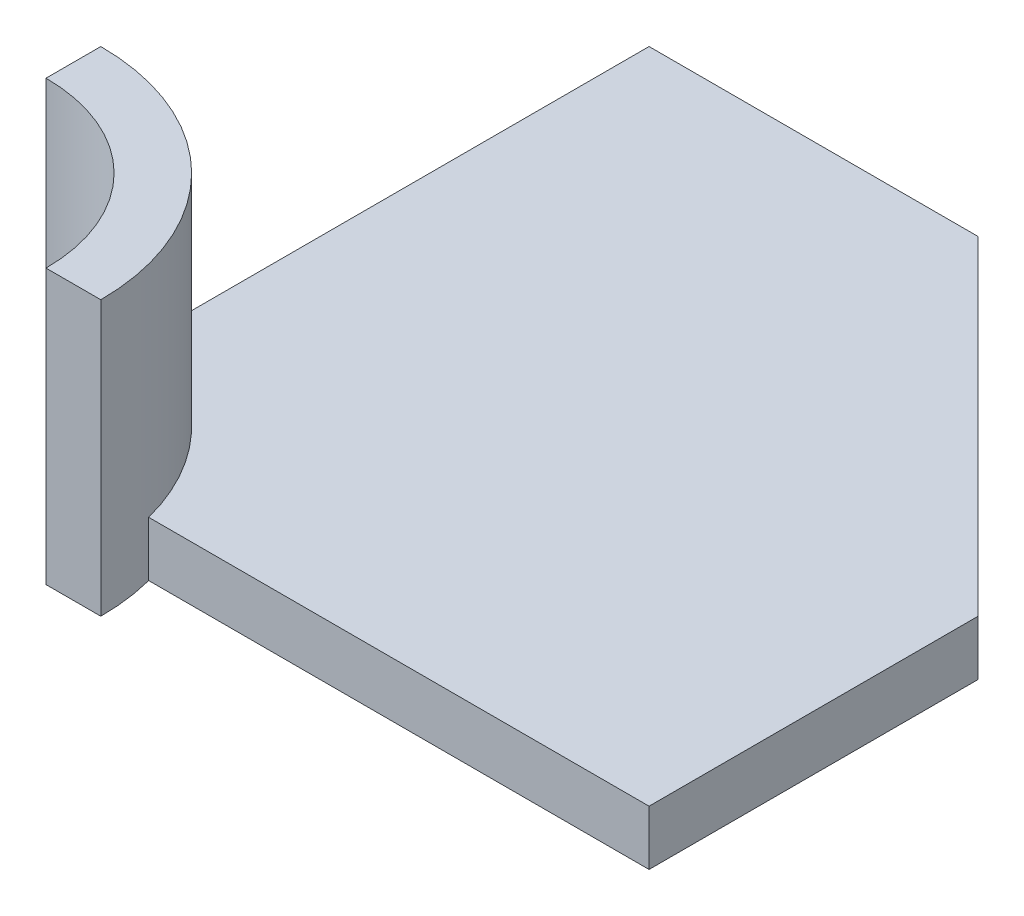
ISO-10303-21;
HEADER;
FILE_DESCRIPTION(('STEP AP214'),'2;1');
FILE_NAME('part.step','',(''),(''),'','','');
FILE_SCHEMA(('AUTOMOTIVE_DESIGN { 1 0 10303 214 1 1 1 1 }'));
ENDSEC;
DATA;
#1=APPLICATION_CONTEXT('core data for automotive mechanical design processes');
#2=APPLICATION_PROTOCOL_DEFINITION('international standard','automotive_design',2000,#1);
#3=PRODUCT_CONTEXT('',#1,'mechanical');
#4=PRODUCT('Part','Part','',(#3));
#5=PRODUCT_RELATED_PRODUCT_CATEGORY('part','',(#4));
#6=PRODUCT_DEFINITION_FORMATION('','',#4);
#7=PRODUCT_DEFINITION_CONTEXT('part definition',#1,'design');
#8=PRODUCT_DEFINITION('design','',#6,#7);
#9=PRODUCT_DEFINITION_SHAPE('','',#8);
#10=(LENGTH_UNIT() NAMED_UNIT(*) SI_UNIT(.MILLI.,.METRE.));
#11=(NAMED_UNIT(*) PLANE_ANGLE_UNIT() SI_UNIT($,.RADIAN.));
#12=(NAMED_UNIT(*) SI_UNIT($,.STERADIAN.) SOLID_ANGLE_UNIT());
#13=UNCERTAINTY_MEASURE_WITH_UNIT(LENGTH_MEASURE(1.E-05),#10,'distance_accuracy_value','');
#14=(GEOMETRIC_REPRESENTATION_CONTEXT(3) GLOBAL_UNCERTAINTY_ASSIGNED_CONTEXT((#13)) GLOBAL_UNIT_ASSIGNED_CONTEXT((#10,
#11,#12)) REPRESENTATION_CONTEXT('',''));
#15=CARTESIAN_POINT('',(0.,0.,0.));
#16=DIRECTION('',(0.,0.,1.));
#17=DIRECTION('',(1.,0.,0.));
#18=AXIS2_PLACEMENT_3D('',#15,#16,#17);
#19=CARTESIAN_POINT('',(-1.25,-0.05,1.));
#20=DIRECTION('',(0.,1.,0.));
#21=DIRECTION('',(0.,0.,1.));
#22=AXIS2_PLACEMENT_3D('',#19,#20,#21);
#23=CYLINDRICAL_SURFACE('',#22,0.2);
#24=DIRECTION('',(0.,1.,0.));
#25=VECTOR('',#24,1.);
#26=CARTESIAN_POINT('',(-1.05635083268963,-0.898528137423858,0.95));
#27=LINE('',#26,#25);
#28=CARTESIAN_POINT('',(-1.05635083268963,-0.05,0.95));
#29=VERTEX_POINT('',#28);
#30=CARTESIAN_POINT('',(-1.05635083268963,0.,0.95));
#31=VERTEX_POINT('',#30);
#32=EDGE_CURVE('E11',#29,#31,#27,.T.);
#33=ORIENTED_EDGE('',*,*,#32,.T.);
#34=CARTESIAN_POINT('',(-1.25,0.,1.));
#35=DIRECTION('',(0.,-1.,0.));
#36=DIRECTION('',(0.,0.,-1.));
#37=AXIS2_PLACEMENT_3D('',#34,#35,#36);
#38=CIRCLE('',#37,0.2);
#39=CARTESIAN_POINT('',(-1.2,0.,0.806350832689629));
#40=VERTEX_POINT('',#39);
#41=EDGE_CURVE('E24',#40,#31,#38,.T.);
#42=ORIENTED_EDGE('',*,*,#41,.F.);
#43=DIRECTION('',(0.,1.,0.));
#44=VECTOR('',#43,1.);
#45=CARTESIAN_POINT('',(-1.2,-0.898528137423858,0.806350832689629));
#46=LINE('',#45,#44);
#47=CARTESIAN_POINT('',(-1.2,-0.05,0.806350832689629));
#48=VERTEX_POINT('',#47);
#49=EDGE_CURVE('E115',#48,#40,#46,.T.);
#50=ORIENTED_EDGE('',*,*,#49,.F.);
#51=CARTESIAN_POINT('',(-1.25,-0.05,1.));
#52=DIRECTION('',(0.,1.,0.));
#53=DIRECTION('',(0.,0.,-1.));
#54=AXIS2_PLACEMENT_3D('',#51,#52,#53);
#55=CIRCLE('',#54,0.2);
#56=CARTESIAN_POINT('',(-1.25,-0.05,0.8));
#57=VERTEX_POINT('',#56);
#58=EDGE_CURVE('E172',#48,#57,#55,.T.);
#59=ORIENTED_EDGE('',*,*,#58,.T.);
#60=DIRECTION('',(0.,1.,0.));
#61=VECTOR('',#60,1.);
#62=CARTESIAN_POINT('',(-1.25,-0.05,0.8));
#63=LINE('',#62,#61);
#64=CARTESIAN_POINT('',(-1.25,0.2,0.8));
#65=VERTEX_POINT('',#64);
#66=EDGE_CURVE('E170',#57,#65,#63,.T.);
#67=ORIENTED_EDGE('',*,*,#66,.T.);
#68=CARTESIAN_POINT('',(-1.25,0.2,1.));
#69=DIRECTION('',(0.,1.,0.));
#70=DIRECTION('',(0.,0.,-1.));
#71=AXIS2_PLACEMENT_3D('',#68,#69,#70);
#72=CIRCLE('',#71,0.2);
#73=CARTESIAN_POINT('',(-1.05,0.2,1.));
#74=VERTEX_POINT('',#73);
#75=EDGE_CURVE('E167',#74,#65,#72,.T.);
#76=ORIENTED_EDGE('',*,*,#75,.F.);
#77=DIRECTION('',(0.,1.,0.));
#78=VECTOR('',#77,1.);
#79=CARTESIAN_POINT('',(-1.05,-0.05,1.));
#80=LINE('',#79,#78);
#81=CARTESIAN_POINT('',(-1.05,-0.05,1.));
#82=VERTEX_POINT('',#81);
#83=EDGE_CURVE('E164',#82,#74,#80,.T.);
#84=ORIENTED_EDGE('',*,*,#83,.F.);
#85=CARTESIAN_POINT('',(-1.25,-0.05,1.));
#86=DIRECTION('',(0.,1.,0.));
#87=DIRECTION('',(0.,0.,-1.));
#88=AXIS2_PLACEMENT_3D('',#85,#86,#87);
#89=CIRCLE('',#88,0.2);
#90=EDGE_CURVE('E162',#82,#29,#89,.T.);
#91=ORIENTED_EDGE('',*,*,#90,.T.);
#92=EDGE_LOOP('',(#33,#42,#50,#59,#67,#76,#84,#91));
#93=FACE_BOUND('',#92,.T.);
#94=ADVANCED_FACE('F17',(#93),#23,.T.);
#95=CARTESIAN_POINT('',(-1.25,-0.05,1.));
#96=DIRECTION('',(0.,1.,0.));
#97=DIRECTION('',(0.,0.,1.));
#98=AXIS2_PLACEMENT_3D('',#95,#96,#97);
#99=CYLINDRICAL_SURFACE('',#98,0.15);
#100=DIRECTION('',(0.,1.,0.));
#101=VECTOR('',#100,1.);
#102=CARTESIAN_POINT('',(-1.25,-0.05,0.85));
#103=LINE('',#102,#101);
#104=CARTESIAN_POINT('',(-1.25,-0.05,0.85));
#105=VERTEX_POINT('',#104);
#106=CARTESIAN_POINT('',(-1.25,0.2,0.85));
#107=VERTEX_POINT('',#106);
#108=EDGE_CURVE('E159',#105,#107,#103,.T.);
#109=ORIENTED_EDGE('',*,*,#108,.F.);
#110=CARTESIAN_POINT('',(-1.25,-0.05,1.));
#111=DIRECTION('',(0.,-1.,0.));
#112=DIRECTION('',(0.,0.,-1.));
#113=AXIS2_PLACEMENT_3D('',#110,#111,#112);
#114=CIRCLE('',#113,0.15);
#115=CARTESIAN_POINT('',(-1.1,-0.05,1.));
#116=VERTEX_POINT('',#115);
#117=EDGE_CURVE('E156',#105,#116,#114,.T.);
#118=ORIENTED_EDGE('',*,*,#117,.T.);
#119=DIRECTION('',(0.,1.,0.));
#120=VECTOR('',#119,1.);
#121=CARTESIAN_POINT('',(-1.1,-0.05,1.));
#122=LINE('',#121,#120);
#123=CARTESIAN_POINT('',(-1.1,0.2,1.));
#124=VERTEX_POINT('',#123);
#125=EDGE_CURVE('E153',#116,#124,#122,.T.);
#126=ORIENTED_EDGE('',*,*,#125,.T.);
#127=CARTESIAN_POINT('',(-1.25,0.2,1.));
#128=DIRECTION('',(0.,-1.,0.));
#129=DIRECTION('',(0.,0.,-1.));
#130=AXIS2_PLACEMENT_3D('',#127,#128,#129);
#131=CIRCLE('',#130,0.15);
#132=EDGE_CURVE('E151',#107,#124,#131,.T.);
#133=ORIENTED_EDGE('',*,*,#132,.F.);
#134=EDGE_LOOP('',(#109,#118,#126,#133));
#135=FACE_BOUND('',#134,.T.);
#136=ADVANCED_FACE('F199',(#135),#99,.F.);
#137=CARTESIAN_POINT('',(-1.05,-0.05,1.));
#138=DIRECTION('',(0.,0.,-1.));
#139=DIRECTION('',(1.,0.,0.));
#140=AXIS2_PLACEMENT_3D('',#137,#138,#139);
#141=PLANE('',#140);
#142=ORIENTED_EDGE('',*,*,#125,.F.);
#143=DIRECTION('',(1.,0.,0.));
#144=VECTOR('',#143,1.);
#145=CARTESIAN_POINT('',(-1.05,-0.05,1.));
#146=LINE('',#145,#144);
#147=EDGE_CURVE('E148',#116,#82,#146,.T.);
#148=ORIENTED_EDGE('',*,*,#147,.T.);
#149=ORIENTED_EDGE('',*,*,#83,.T.);
#150=DIRECTION('',(1.,0.,0.));
#151=VECTOR('',#150,1.);
#152=CARTESIAN_POINT('',(-1.05,0.2,1.));
#153=LINE('',#152,#151);
#154=EDGE_CURVE('E145',#124,#74,#153,.T.);
#155=ORIENTED_EDGE('',*,*,#154,.F.);
#156=EDGE_LOOP('',(#142,#148,#149,#155));
#157=FACE_BOUND('',#156,.T.);
#158=ADVANCED_FACE('F196',(#157),#141,.F.);
#159=CARTESIAN_POINT('',(-1.25,-0.05,0.85));
#160=DIRECTION('',(1.,0.,0.));
#161=DIRECTION('',(0.,0.,1.));
#162=AXIS2_PLACEMENT_3D('',#159,#160,#161);
#163=PLANE('',#162);
#164=ORIENTED_EDGE('',*,*,#66,.F.);
#165=DIRECTION('',(0.,0.,1.));
#166=VECTOR('',#165,1.);
#167=CARTESIAN_POINT('',(-1.25,-0.05,0.85));
#168=LINE('',#167,#166);
#169=EDGE_CURVE('E142',#57,#105,#168,.T.);
#170=ORIENTED_EDGE('',*,*,#169,.T.);
#171=ORIENTED_EDGE('',*,*,#108,.T.);
#172=DIRECTION('',(0.,0.,1.));
#173=VECTOR('',#172,1.);
#174=CARTESIAN_POINT('',(-1.25,0.2,0.85));
#175=LINE('',#174,#173);
#176=EDGE_CURVE('E139',#65,#107,#175,.T.);
#177=ORIENTED_EDGE('',*,*,#176,.F.);
#178=EDGE_LOOP('',(#164,#170,#171,#177));
#179=FACE_BOUND('',#178,.T.);
#180=ADVANCED_FACE('F189',(#179),#163,.F.);
#181=CARTESIAN_POINT('',(-1.25,-0.05,1.));
#182=DIRECTION('',(0.,-1.,0.));
#183=DIRECTION('',(0.,0.,-1.));
#184=AXIS2_PLACEMENT_3D('',#181,#182,#183);
#185=PLANE('',#184);
#186=DIRECTION('',(-0.707106781186551,0.,-0.707106781186544));
#187=VECTOR('',#186,1.);
#188=CARTESIAN_POINT('',(-0.6,-0.05,0.649999999999997));
#189=LINE('',#188,#187);
#190=CARTESIAN_POINT('',(-0.6,-0.05,0.649999999999997));
#191=VERTEX_POINT('',#190);
#192=CARTESIAN_POINT('',(-0.9,-0.05,0.35));
#193=VERTEX_POINT('',#192);
#194=EDGE_CURVE('E137',#191,#193,#189,.T.);
#195=ORIENTED_EDGE('',*,*,#194,.F.);
#196=DIRECTION('',(0.,0.,-1.));
#197=VECTOR('',#196,1.);
#198=CARTESIAN_POINT('',(-0.6,-0.05,0.95));
#199=LINE('',#198,#197);
#200=CARTESIAN_POINT('',(-0.6,-0.05,0.95));
#201=VERTEX_POINT('',#200);
#202=EDGE_CURVE('E134',#201,#191,#199,.T.);
#203=ORIENTED_EDGE('',*,*,#202,.F.);
#204=DIRECTION('',(1.,0.,0.));
#205=VECTOR('',#204,1.);
#206=CARTESIAN_POINT('',(-1.05635083268963,-0.05,0.95));
#207=LINE('',#206,#205);
#208=EDGE_CURVE('E132',#29,#201,#207,.T.);
#209=ORIENTED_EDGE('',*,*,#208,.F.);
#210=ORIENTED_EDGE('',*,*,#90,.F.);
#211=ORIENTED_EDGE('',*,*,#147,.F.);
#212=ORIENTED_EDGE('',*,*,#117,.F.);
#213=ORIENTED_EDGE('',*,*,#169,.F.);
#214=ORIENTED_EDGE('',*,*,#58,.F.);
#215=DIRECTION('',(0.,0.,1.));
#216=VECTOR('',#215,1.);
#217=CARTESIAN_POINT('',(-1.2,-0.05,0.35));
#218=LINE('',#217,#216);
#219=CARTESIAN_POINT('',(-1.2,-0.05,0.35));
#220=VERTEX_POINT('',#219);
#221=EDGE_CURVE('E130',#220,#48,#218,.T.);
#222=ORIENTED_EDGE('',*,*,#221,.F.);
#223=DIRECTION('',(-1.,0.,0.));
#224=VECTOR('',#223,1.);
#225=CARTESIAN_POINT('',(-0.6,-0.05,0.35));
#226=LINE('',#225,#224);
#227=EDGE_CURVE('E109',#193,#220,#226,.T.);
#228=ORIENTED_EDGE('',*,*,#227,.F.);
#229=EDGE_LOOP('',(#195,#203,#209,#210,#211,#212,#213,#214,#222,#228));
#230=FACE_BOUND('',#229,.T.);
#231=ADVANCED_FACE('F183',(#230),#185,.T.);
#232=CARTESIAN_POINT('',(-1.25,0.2,1.));
#233=DIRECTION('',(0.,-1.,0.));
#234=DIRECTION('',(0.,0.,-1.));
#235=AXIS2_PLACEMENT_3D('',#232,#233,#234);
#236=PLANE('',#235);
#237=ORIENTED_EDGE('',*,*,#132,.T.);
#238=ORIENTED_EDGE('',*,*,#154,.T.);
#239=ORIENTED_EDGE('',*,*,#75,.T.);
#240=ORIENTED_EDGE('',*,*,#176,.T.);
#241=EDGE_LOOP('',(#237,#238,#239,#240));
#242=FACE_BOUND('',#241,.T.);
#243=ADVANCED_FACE('F192',(#242),#236,.F.);
#244=CARTESIAN_POINT('',(-1.05635083268963,-0.898528137423858,0.95));
#245=DIRECTION('',(0.,0.,-1.));
#246=DIRECTION('',(1.,0.,0.));
#247=AXIS2_PLACEMENT_3D('',#244,#245,#246);
#248=PLANE('',#247);
#249=ORIENTED_EDGE('',*,*,#208,.T.);
#250=DIRECTION('',(0.,1.,0.));
#251=VECTOR('',#250,1.);
#252=CARTESIAN_POINT('',(-0.6,-0.898528137423858,0.95));
#253=LINE('',#252,#251);
#254=CARTESIAN_POINT('',(-0.6,0.,0.95));
#255=VERTEX_POINT('',#254);
#256=EDGE_CURVE('E127',#201,#255,#253,.T.);
#257=ORIENTED_EDGE('',*,*,#256,.T.);
#258=DIRECTION('',(1.,0.,0.));
#259=VECTOR('',#258,1.);
#260=CARTESIAN_POINT('',(-1.05635083268963,0.,0.95));
#261=LINE('',#260,#259);
#262=EDGE_CURVE('E124',#31,#255,#261,.T.);
#263=ORIENTED_EDGE('',*,*,#262,.F.);
#264=ORIENTED_EDGE('',*,*,#32,.F.);
#265=EDGE_LOOP('',(#249,#257,#263,#264));
#266=FACE_BOUND('',#265,.T.);
#267=ADVANCED_FACE('F175',(#266),#248,.F.);
#268=CARTESIAN_POINT('',(-0.6,-0.898528137423858,0.95));
#269=DIRECTION('',(-1.,0.,0.));
#270=DIRECTION('',(0.,0.,-1.));
#271=AXIS2_PLACEMENT_3D('',#268,#269,#270);
#272=PLANE('',#271);
#273=ORIENTED_EDGE('',*,*,#202,.T.);
#274=DIRECTION('',(0.,-1.,0.));
#275=VECTOR('',#274,1.);
#276=CARTESIAN_POINT('',(-0.6,0.651,0.649999999999997));
#277=LINE('',#276,#275);
#278=CARTESIAN_POINT('',(-0.6,0.,0.649999999999997));
#279=VERTEX_POINT('',#278);
#280=EDGE_CURVE('E121',#279,#191,#277,.T.);
#281=ORIENTED_EDGE('',*,*,#280,.F.);
#282=DIRECTION('',(0.,0.,-1.));
#283=VECTOR('',#282,1.);
#284=CARTESIAN_POINT('',(-0.6,0.,0.95));
#285=LINE('',#284,#283);
#286=EDGE_CURVE('E101',#255,#279,#285,.T.);
#287=ORIENTED_EDGE('',*,*,#286,.F.);
#288=ORIENTED_EDGE('',*,*,#256,.F.);
#289=EDGE_LOOP('',(#273,#281,#287,#288));
#290=FACE_BOUND('',#289,.T.);
#291=ADVANCED_FACE('F179',(#290),#272,.F.);
#292=CARTESIAN_POINT('',(-0.6,-0.898528137423858,0.35));
#293=DIRECTION('',(0.,0.,1.));
#294=DIRECTION('',(-1.,0.,0.));
#295=AXIS2_PLACEMENT_3D('',#292,#293,#294);
#296=PLANE('',#295);
#297=DIRECTION('',(-1.,0.,0.));
#298=VECTOR('',#297,1.);
#299=CARTESIAN_POINT('',(-0.6,0.,0.35));
#300=LINE('',#299,#298);
#301=CARTESIAN_POINT('',(-0.9,0.,0.35));
#302=VERTEX_POINT('',#301);
#303=CARTESIAN_POINT('',(-1.2,0.,0.35));
#304=VERTEX_POINT('',#303);
#305=EDGE_CURVE('E90',#302,#304,#300,.T.);
#306=ORIENTED_EDGE('',*,*,#305,.F.);
#307=DIRECTION('',(0.,-1.,0.));
#308=VECTOR('',#307,1.);
#309=CARTESIAN_POINT('',(-0.9,0.651,0.35));
#310=LINE('',#309,#308);
#311=EDGE_CURVE('E102',#302,#193,#310,.T.);
#312=ORIENTED_EDGE('',*,*,#311,.T.);
#313=ORIENTED_EDGE('',*,*,#227,.T.);
#314=DIRECTION('',(0.,1.,0.));
#315=VECTOR('',#314,1.);
#316=CARTESIAN_POINT('',(-1.2,-0.898528137423858,0.35));
#317=LINE('',#316,#315);
#318=EDGE_CURVE('E106',#220,#304,#317,.T.);
#319=ORIENTED_EDGE('',*,*,#318,.T.);
#320=EDGE_LOOP('',(#306,#312,#313,#319));
#321=FACE_BOUND('',#320,.T.);
#322=ADVANCED_FACE('F107',(#321),#296,.F.);
#323=CARTESIAN_POINT('',(-1.2,-0.898528137423858,0.35));
#324=DIRECTION('',(1.,0.,0.));
#325=DIRECTION('',(0.,0.,1.));
#326=AXIS2_PLACEMENT_3D('',#323,#324,#325);
#327=PLANE('',#326);
#328=ORIENTED_EDGE('',*,*,#221,.T.);
#329=ORIENTED_EDGE('',*,*,#49,.T.);
#330=DIRECTION('',(0.,0.,1.));
#331=VECTOR('',#330,1.);
#332=CARTESIAN_POINT('',(-1.2,0.,0.35));
#333=LINE('',#332,#331);
#334=EDGE_CURVE('E95',#304,#40,#333,.T.);
#335=ORIENTED_EDGE('',*,*,#334,.F.);
#336=ORIENTED_EDGE('',*,*,#318,.F.);
#337=EDGE_LOOP('',(#328,#329,#335,#336));
#338=FACE_BOUND('',#337,.T.);
#339=ADVANCED_FACE('F114',(#338),#327,.F.);
#340=CARTESIAN_POINT('',(-1.25,0.,1.));
#341=DIRECTION('',(0.,-1.,0.));
#342=DIRECTION('',(0.,0.,-1.));
#343=AXIS2_PLACEMENT_3D('',#340,#341,#342);
#344=PLANE('',#343);
#345=ORIENTED_EDGE('',*,*,#286,.T.);
#346=DIRECTION('',(0.707106781186551,0.,0.707106781186544));
#347=VECTOR('',#346,1.);
#348=CARTESIAN_POINT('',(-0.6,0.,0.649999999999997));
#349=LINE('',#348,#347);
#350=EDGE_CURVE('E97',#302,#279,#349,.T.);
#351=ORIENTED_EDGE('',*,*,#350,.F.);
#352=ORIENTED_EDGE('',*,*,#305,.T.);
#353=ORIENTED_EDGE('',*,*,#334,.T.);
#354=ORIENTED_EDGE('',*,*,#41,.T.);
#355=ORIENTED_EDGE('',*,*,#262,.T.);
#356=EDGE_LOOP('',(#345,#351,#352,#353,#354,#355));
#357=FACE_BOUND('',#356,.T.);
#358=ADVANCED_FACE('F93',(#357),#344,.F.);
#359=CARTESIAN_POINT('',(-0.6,0.651,0.649999999999997));
#360=DIRECTION('',(-0.707106781186544,0.,0.707106781186551));
#361=DIRECTION('',(0.707106781186551,0.,0.707106781186544));
#362=AXIS2_PLACEMENT_3D('',#359,#360,#361);
#363=PLANE('',#362);
#364=ORIENTED_EDGE('',*,*,#350,.T.);
#365=ORIENTED_EDGE('',*,*,#280,.T.);
#366=ORIENTED_EDGE('',*,*,#194,.T.);
#367=ORIENTED_EDGE('',*,*,#311,.F.);
#368=EDGE_LOOP('',(#364,#365,#366,#367));
#369=FACE_BOUND('',#368,.T.);
#370=ADVANCED_FACE('F181',(#369),#363,.F.);
#371=CLOSED_SHELL('',(#94,#136,#158,#180,#231,#243,#267,#291,#322,#339,#358,#370));
#372=MANIFOLD_SOLID_BREP('B1',#371);
#373=ADVANCED_BREP_SHAPE_REPRESENTATION('',(#18,#372),#14);
#374=SHAPE_DEFINITION_REPRESENTATION(#9,#373);
ENDSEC;
END-ISO-10303-21;
